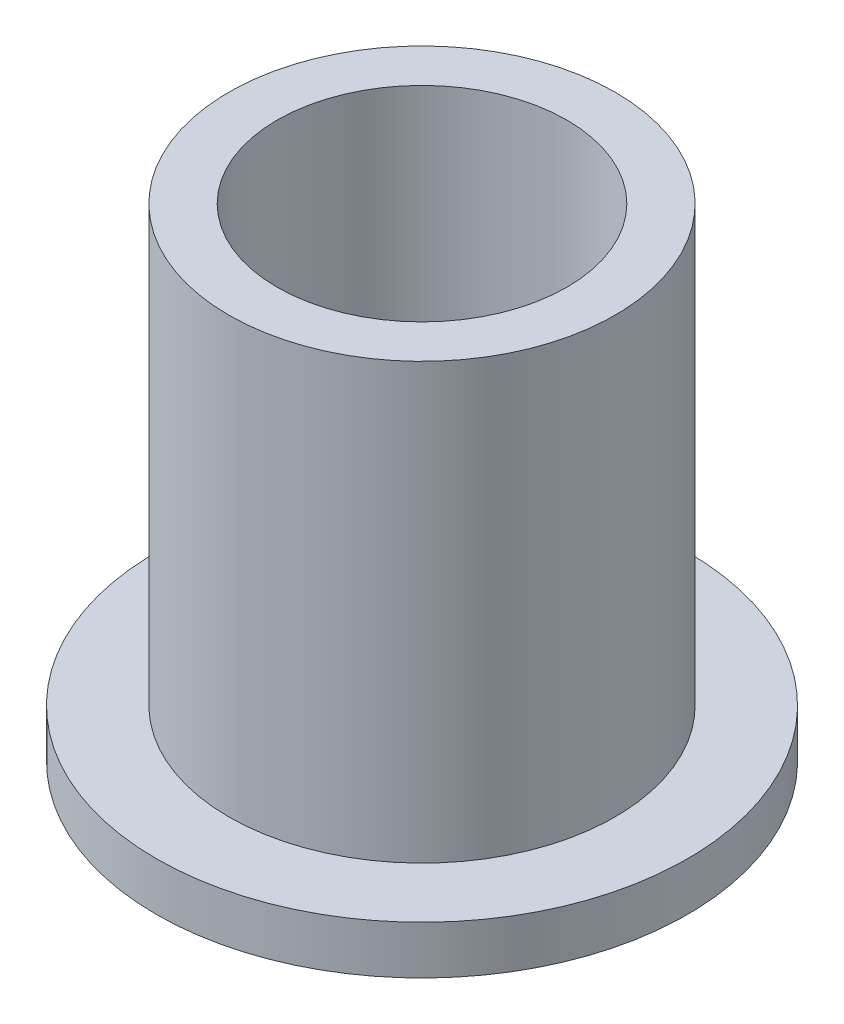
ISO-10303-21;
HEADER;
FILE_DESCRIPTION(('STEP AP214'),'2;1');
FILE_NAME('part.step','',(''),(''),'','','');
FILE_SCHEMA(('AUTOMOTIVE_DESIGN { 1 0 10303 214 1 1 1 1 }'));
ENDSEC;
DATA;
#1=APPLICATION_CONTEXT('core data for automotive mechanical design processes');
#2=APPLICATION_PROTOCOL_DEFINITION('international standard','automotive_design',2000,#1);
#3=PRODUCT_CONTEXT('',#1,'mechanical');
#4=PRODUCT('Part','Part','',(#3));
#5=PRODUCT_RELATED_PRODUCT_CATEGORY('part','',(#4));
#6=PRODUCT_DEFINITION_FORMATION('','',#4);
#7=PRODUCT_DEFINITION_CONTEXT('part definition',#1,'design');
#8=PRODUCT_DEFINITION('design','',#6,#7);
#9=PRODUCT_DEFINITION_SHAPE('','',#8);
#10=(LENGTH_UNIT() NAMED_UNIT(*) SI_UNIT(.MILLI.,.METRE.));
#11=(NAMED_UNIT(*) PLANE_ANGLE_UNIT() SI_UNIT($,.RADIAN.));
#12=(NAMED_UNIT(*) SI_UNIT($,.STERADIAN.) SOLID_ANGLE_UNIT());
#13=UNCERTAINTY_MEASURE_WITH_UNIT(LENGTH_MEASURE(1.E-05),#10,'distance_accuracy_value','');
#14=(GEOMETRIC_REPRESENTATION_CONTEXT(3) GLOBAL_UNCERTAINTY_ASSIGNED_CONTEXT((#13)) GLOBAL_UNIT_ASSIGNED_CONTEXT((#10,
#11,#12)) REPRESENTATION_CONTEXT('',''));
#15=CARTESIAN_POINT('',(0.,0.,0.));
#16=DIRECTION('',(0.,0.,1.));
#17=DIRECTION('',(1.,0.,0.));
#18=AXIS2_PLACEMENT_3D('',#15,#16,#17);
#19=CARTESIAN_POINT('',(0.,20.,0.));
#20=DIRECTION('',(0.,1.,0.));
#21=DIRECTION('',(0.,0.,1.));
#22=AXIS2_PLACEMENT_3D('',#19,#20,#21);
#23=PLANE('',#22);
#24=CARTESIAN_POINT('',(0.,20.,0.));
#25=DIRECTION('',(0.,1.,0.));
#26=DIRECTION('',(0.,0.,1.));
#27=AXIS2_PLACEMENT_3D('',#24,#25,#26);
#28=CIRCLE('',#27,8.);
#29=CARTESIAN_POINT('',(0.,20.,8.));
#30=VERTEX_POINT('',#29);
#31=EDGE_CURVE('E10',#30,#30,#28,.T.);
#32=ORIENTED_EDGE('',*,*,#31,.T.);
#33=EDGE_LOOP('',(#32));
#34=FACE_BOUND('',#33,.T.);
#35=CARTESIAN_POINT('',(0.,20.,0.));
#36=DIRECTION('',(0.,1.,0.));
#37=DIRECTION('',(0.,0.,1.));
#38=AXIS2_PLACEMENT_3D('',#35,#36,#37);
#39=CIRCLE('',#38,6.);
#40=CARTESIAN_POINT('',(0.,20.,6.));
#41=VERTEX_POINT('',#40);
#42=EDGE_CURVE('E39',#41,#41,#39,.T.);
#43=ORIENTED_EDGE('',*,*,#42,.F.);
#44=EDGE_LOOP('',(#43));
#45=FACE_BOUND('',#44,.T.);
#46=ADVANCED_FACE('F32',(#34,#45),#23,.T.);
#47=CARTESIAN_POINT('',(0.,0.,0.));
#48=DIRECTION('',(0.,1.,0.));
#49=DIRECTION('',(0.,0.,1.));
#50=AXIS2_PLACEMENT_3D('',#47,#48,#49);
#51=PLANE('',#50);
#52=CARTESIAN_POINT('',(0.,0.,0.));
#53=DIRECTION('',(0.,1.,0.));
#54=DIRECTION('',(0.,0.,1.));
#55=AXIS2_PLACEMENT_3D('',#52,#53,#54);
#56=CIRCLE('',#55,6.);
#57=CARTESIAN_POINT('',(0.,0.,6.));
#58=VERTEX_POINT('',#57);
#59=EDGE_CURVE('E43',#58,#58,#56,.T.);
#60=ORIENTED_EDGE('',*,*,#59,.T.);
#61=EDGE_LOOP('',(#60));
#62=FACE_BOUND('',#61,.T.);
#63=CARTESIAN_POINT('',(0.,0.,0.));
#64=DIRECTION('',(0.,1.,0.));
#65=DIRECTION('',(0.,0.,1.));
#66=AXIS2_PLACEMENT_3D('',#63,#64,#65);
#67=CIRCLE('',#66,11.);
#68=CARTESIAN_POINT('',(0.,0.,11.));
#69=VERTEX_POINT('',#68);
#70=EDGE_CURVE('E50',#69,#69,#67,.T.);
#71=ORIENTED_EDGE('',*,*,#70,.F.);
#72=EDGE_LOOP('',(#71));
#73=FACE_BOUND('',#72,.T.);
#74=ADVANCED_FACE('F75',(#62,#73),#51,.F.);
#75=CARTESIAN_POINT('',(0.,20.,0.));
#76=DIRECTION('',(0.,-1.,0.));
#77=DIRECTION('',(0.,0.,-1.));
#78=AXIS2_PLACEMENT_3D('',#75,#76,#77);
#79=CYLINDRICAL_SURFACE('',#78,8.);
#80=CARTESIAN_POINT('',(0.,2.,0.));
#81=DIRECTION('',(0.,1.,0.));
#82=DIRECTION('',(0.,0.,1.));
#83=AXIS2_PLACEMENT_3D('',#80,#81,#82);
#84=CIRCLE('',#83,8.);
#85=CARTESIAN_POINT('',(0.,2.,8.));
#86=VERTEX_POINT('',#85);
#87=EDGE_CURVE('E53',#86,#86,#84,.T.);
#88=ORIENTED_EDGE('',*,*,#87,.T.);
#89=EDGE_LOOP('',(#88));
#90=FACE_BOUND('',#89,.T.);
#91=ORIENTED_EDGE('',*,*,#31,.F.);
#92=EDGE_LOOP('',(#91));
#93=FACE_BOUND('',#92,.T.);
#94=ADVANCED_FACE('F34',(#90,#93),#79,.T.);
#95=CARTESIAN_POINT('',(0.,20.,0.));
#96=DIRECTION('',(0.,-1.,0.));
#97=DIRECTION('',(0.,0.,-1.));
#98=AXIS2_PLACEMENT_3D('',#95,#96,#97);
#99=CYLINDRICAL_SURFACE('',#98,6.);
#100=ORIENTED_EDGE('',*,*,#42,.T.);
#101=EDGE_LOOP('',(#100));
#102=FACE_BOUND('',#101,.T.);
#103=ORIENTED_EDGE('',*,*,#59,.F.);
#104=EDGE_LOOP('',(#103));
#105=FACE_BOUND('',#104,.T.);
#106=ADVANCED_FACE('F64',(#102,#105),#99,.F.);
#107=CARTESIAN_POINT('',(0.,2.,0.));
#108=DIRECTION('',(0.,1.,0.));
#109=DIRECTION('',(0.,0.,1.));
#110=AXIS2_PLACEMENT_3D('',#107,#108,#109);
#111=PLANE('',#110);
#112=CARTESIAN_POINT('',(0.,2.,0.));
#113=DIRECTION('',(0.,1.,0.));
#114=DIRECTION('',(0.,0.,1.));
#115=AXIS2_PLACEMENT_3D('',#112,#113,#114);
#116=CIRCLE('',#115,11.);
#117=CARTESIAN_POINT('',(0.,2.,11.));
#118=VERTEX_POINT('',#117);
#119=EDGE_CURVE('E48',#118,#118,#116,.T.);
#120=ORIENTED_EDGE('',*,*,#119,.T.);
#121=EDGE_LOOP('',(#120));
#122=FACE_BOUND('',#121,.T.);
#123=ORIENTED_EDGE('',*,*,#87,.F.);
#124=EDGE_LOOP('',(#123));
#125=FACE_BOUND('',#124,.T.);
#126=ADVANCED_FACE('F61',(#122,#125),#111,.T.);
#127=CARTESIAN_POINT('',(0.,2.,0.));
#128=DIRECTION('',(0.,-1.,0.));
#129=DIRECTION('',(0.,0.,-1.));
#130=AXIS2_PLACEMENT_3D('',#127,#128,#129);
#131=CYLINDRICAL_SURFACE('',#130,11.);
#132=ORIENTED_EDGE('',*,*,#119,.F.);
#133=EDGE_LOOP('',(#132));
#134=FACE_BOUND('',#133,.T.);
#135=ORIENTED_EDGE('',*,*,#70,.T.);
#136=EDGE_LOOP('',(#135));
#137=FACE_BOUND('',#136,.T.);
#138=ADVANCED_FACE('F63',(#134,#137),#131,.T.);
#139=CLOSED_SHELL('',(#46,#74,#94,#106,#126,#138));
#140=MANIFOLD_SOLID_BREP('B2',#139);
#141=ADVANCED_BREP_SHAPE_REPRESENTATION('',(#18,#140),#14);
#142=SHAPE_DEFINITION_REPRESENTATION(#9,#141);
ENDSEC;
END-ISO-10303-21;
